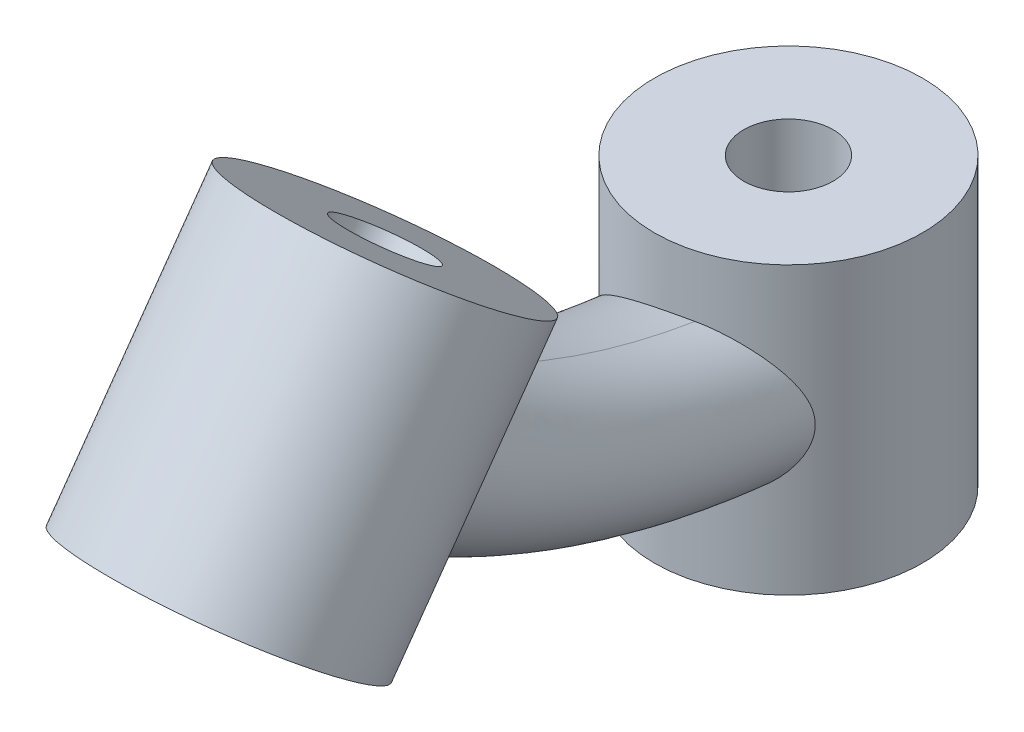
ISO-10303-21;
HEADER;
FILE_DESCRIPTION(('STEP AP214'),'2;1');
FILE_NAME('part.step','',(''),(''),'','','');
FILE_SCHEMA(('AUTOMOTIVE_DESIGN { 1 0 10303 214 1 1 1 1 }'));
ENDSEC;
DATA;
#1=APPLICATION_CONTEXT('core data for automotive mechanical design processes');
#2=APPLICATION_PROTOCOL_DEFINITION('international standard','automotive_design',2000,#1);
#3=PRODUCT_CONTEXT('',#1,'mechanical');
#4=PRODUCT('Part','Part','',(#3));
#5=PRODUCT_RELATED_PRODUCT_CATEGORY('part','',(#4));
#6=PRODUCT_DEFINITION_FORMATION('','',#4);
#7=PRODUCT_DEFINITION_CONTEXT('part definition',#1,'design');
#8=PRODUCT_DEFINITION('design','',#6,#7);
#9=PRODUCT_DEFINITION_SHAPE('','',#8);
#10=(LENGTH_UNIT() NAMED_UNIT(*) SI_UNIT(.MILLI.,.METRE.));
#11=(NAMED_UNIT(*) PLANE_ANGLE_UNIT() SI_UNIT($,.RADIAN.));
#12=(NAMED_UNIT(*) SI_UNIT($,.STERADIAN.) SOLID_ANGLE_UNIT());
#13=UNCERTAINTY_MEASURE_WITH_UNIT(LENGTH_MEASURE(1.E-05),#10,'distance_accuracy_value','');
#14=(GEOMETRIC_REPRESENTATION_CONTEXT(3) GLOBAL_UNCERTAINTY_ASSIGNED_CONTEXT((#13)) GLOBAL_UNIT_ASSIGNED_CONTEXT((#10,
#11,#12)) REPRESENTATION_CONTEXT('',''));
#15=CARTESIAN_POINT('',(0.,0.,0.));
#16=DIRECTION('',(0.,0.,1.));
#17=DIRECTION('',(1.,0.,0.));
#18=AXIS2_PLACEMENT_3D('',#15,#16,#17);
#19=CARTESIAN_POINT('',(-0.6,0.,0.));
#20=CARTESIAN_POINT('',(-0.6,0.,0.999999999999338));
#21=CARTESIAN_POINT('',(-0.6,0.290266959117317,1.90711803257191));
#22=CARTESIAN_POINT('',(-0.6,0.870800877353567,2.72135409771308));
#23=CARTESIAN_POINT('',(-0.407571052090886,-0.256571930545485,0.));
#24=CARTESIAN_POINT('',(-0.407571052090886,-0.256571931736255,1.05083716692525));
#25=CARTESIAN_POINT('',(-0.407571052090886,0.0518441392871162,2.0146732866513));
#26=CARTESIAN_POINT('',(-0.407571052090886,0.661890758200323,2.87030280586194));
#27=CARTESIAN_POINT('',(-0.120714913181857,-0.4,0.));
#28=CARTESIAN_POINT('',(-0.120714913181857,-0.400000001857498,1.07925600718421));
#29=CARTESIAN_POINT('',(-0.120714913181857,-0.0814382688464156,2.07479850151535));
#30=CARTESIAN_POINT('',(-0.120714913181857,0.545106451296765,2.95356766500735));
#31=CARTESIAN_POINT('',(0.2,-0.4,0.));
#32=CARTESIAN_POINT('',(0.2,-0.400000001857498,1.07925600718437));
#33=CARTESIAN_POINT('',(0.2,-0.0814382688462907,2.07479850151514));
#34=CARTESIAN_POINT('',(0.2,0.545106451296765,2.95356766500735));
#35=(BOUNDED_SURFACE() B_SPLINE_SURFACE(3,3,((#19,#20,#21,#22),(#23,#24,#25,#26),(#27,#28,#29,
#30),(#31,#32,#33,#34)),.UNSPECIFIED.,.F.,.F.,.F.) B_SPLINE_SURFACE_WITH_KNOTS((4,4),(4,4),(0.,
1.),(0.,1.),.UNSPECIFIED.) GEOMETRIC_REPRESENTATION_ITEM() RATIONAL_B_SPLINE_SURFACE(((1.,1.,1.,
1.),(0.929618127333277,0.929618127333277,0.929618127333277,0.929618127333277),
(0.929618127333277,0.929618127333277,0.929618127333277,0.929618127333277),(1.,1.,1.,1.))) REPRESENTATION_ITEM('') SURFACE());
#36=CARTESIAN_POINT('',(-0.6,0.,0.));
#37=CARTESIAN_POINT('',(-0.6,0.,0.999999999999338));
#38=CARTESIAN_POINT('',(-0.6,0.290266959117317,1.90711803257191));
#39=CARTESIAN_POINT('',(-0.6,0.870800877353567,2.72135409771308));
#40=B_SPLINE_CURVE_WITH_KNOTS('',3,(#36,#37,#38,#39),.UNSPECIFIED.,.F.,.F.,(4,4),(0.,1.),.UNSPECIFIED.);
#41=CARTESIAN_POINT('',(-0.6,0.0201587613450963,0.450000000000001));
#42=VERTEX_POINT('',#41);
#43=CARTESIAN_POINT('',(-0.6,0.625974604663066,2.34324502368889));
#44=VERTEX_POINT('',#43);
#45=EDGE_CURVE('E11',#42,#44,#40,.T.);
#46=CARTESIAN_POINT('',(-0.6,0.0201587613450963,0.45));
#47=CARTESIAN_POINT('',(-0.584587443213233,0.00139531344069298,0.470538525789359));
#48=CARTESIAN_POINT('',(-0.568031378733616,-0.0171719864093529,0.490425282404676));
#49=CARTESIAN_POINT('',(-0.532560625569064,-0.0536873259788895,0.528739702830661));
#50=CARTESIAN_POINT('',(-0.513639854315317,-0.0716336105399426,0.547163395868869));
#51=CARTESIAN_POINT('',(-0.473292904457342,-0.106713995635153,0.582422258254777));
#52=CARTESIAN_POINT('',(-0.451848429824051,-0.12384071617806,0.599243996794583));
#53=CARTESIAN_POINT('',(-0.406633742967167,-0.156832183922296,0.63080005089821));
#54=CARTESIAN_POINT('',(-0.382866411422283,-0.172698451068325,0.645536897856092));
#55=CARTESIAN_POINT('',(-0.325448646158615,-0.207531768345037,0.676720222443428));
#56=CARTESIAN_POINT('',(-0.290996587158312,-0.225966084976135,0.692314461583355));
#57=CARTESIAN_POINT('',(-0.218828158534728,-0.259532512607695,0.718387049720213));
#58=CARTESIAN_POINT('',(-0.181122605215755,-0.274675018090188,0.728881635387156));
#59=CARTESIAN_POINT('',(-0.102907141009716,-0.301251786639477,0.743981971074257));
#60=CARTESIAN_POINT('',(-0.062376422201113,-0.31265399283156,0.748537760541348));
#61=CARTESIAN_POINT('',(0.0198633914054088,-0.331140952992155,0.750859670122158));
#62=CARTESIAN_POINT('',(0.0615712941183749,-0.33822992148127,0.748632430845334));
#63=CARTESIAN_POINT('',(0.11931526124771,-0.345058848003597,0.740633655406134));
#64=CARTESIAN_POINT('',(0.135598967033393,-0.346649338750588,0.737826090288573));
#65=CARTESIAN_POINT('',(0.167963545000202,-0.349168894980234,0.73113606221257));
#66=CARTESIAN_POINT('',(0.184044743552117,-0.350099210365213,0.72725564993294));
#67=CARTESIAN_POINT('',(0.2,-0.350712327549419,0.722841614740117));
#68=B_SPLINE_CURVE_WITH_KNOTS('',3,(#46,#47,#48,#49,#50,#51,#52,#53,#54,#55,#56,#57,#58,#59,#60,
#61,#62,#63,#64,#65,#66,#67),.UNSPECIFIED.,.F.,.F.,(4,2,2,2,2,2,2,2,2,2,4),(0.,
0.0954078810676434,0.191066428818179,0.287467002816868,0.383749507593539,0.509434924609851,
0.634717509177261,0.761047382288681,0.887253617772194,0.937015167500651,0.986682251071779),.UNSPECIFIED.);
#69=CARTESIAN_POINT('',(0.2,-0.350712327549429,0.722841614740047));
#70=VERTEX_POINT('',#69);
#71=EDGE_CURVE('E71',#42,#70,#68,.T.);
#72=CARTESIAN_POINT('',(0.2,-0.4,0.));
#73=CARTESIAN_POINT('',(0.2,-0.400000001857498,1.07925600718437));
#74=CARTESIAN_POINT('',(0.2,-0.0814382688462907,2.07479850151514));
#75=CARTESIAN_POINT('',(0.2,0.545106451296765,2.95356766500735));
#76=B_SPLINE_CURVE_WITH_KNOTS('',3,(#72,#73,#74,#75),.UNSPECIFIED.,.F.,.F.,(4,4),(0.,1.),.UNSPECIFIED.);
#77=CARTESIAN_POINT('',(0.2,0.165604176903971,2.33639078729217));
#78=VERTEX_POINT('',#77);
#79=EDGE_CURVE('E55',#70,#78,#76,.T.);
#80=CARTESIAN_POINT('',(0.200000000000137,0.165604176904175,2.33639078729271));
#81=CARTESIAN_POINT('',(0.181941262604554,0.163266617196625,2.3319193478813));
#82=CARTESIAN_POINT('',(0.163717323877511,0.161660374442873,2.32776896325585));
#83=CARTESIAN_POINT('',(0.127070507381306,0.159937153012685,2.32010387015286));
#84=CARTESIAN_POINT('',(0.1086476715573,0.15981986624351,2.31658903031763));
#85=CARTESIAN_POINT('',(0.0534519281149199,0.161733936090693,2.30701774831416));
#86=CARTESIAN_POINT('',(0.0165679419615086,0.166007306688256,2.30188983672862));
#87=CARTESIAN_POINT('',(-0.0562640213157125,0.180383165161915,2.29400352849927));
#88=CARTESIAN_POINT('',(-0.0922121793480307,0.190484517530904,2.29124467053639));
#89=CARTESIAN_POINT('',(-0.16226292444956,0.21600571236972,2.28785768214124));
#90=CARTESIAN_POINT('',(-0.196365135078597,0.231426634956363,2.28722998471319));
#91=CARTESIAN_POINT('',(-0.263529386862932,0.267699877540855,2.28784124322663));
#92=CARTESIAN_POINT('',(-0.296473422091546,0.288767476877616,2.28916646764925));
#93=CARTESIAN_POINT('',(-0.359181228695517,0.335131993456281,2.29352942979378));
#94=CARTESIAN_POINT('',(-0.388937576992771,0.36043844504315,2.29657106557725));
#95=CARTESIAN_POINT('',(-0.453487372450291,0.422639652869165,2.30524722495249));
#96=CARTESIAN_POINT('',(-0.487074395131384,0.460722084787429,2.31138818811615));
#97=CARTESIAN_POINT('',(-0.532845059641147,0.520796803862251,2.3221659780014));
#98=CARTESIAN_POINT('',(-0.547305024826113,0.541262032674995,2.32600877944175));
#99=CARTESIAN_POINT('',(-0.574746203040941,0.583025760305396,2.33422527822159));
#100=CARTESIAN_POINT('',(-0.587729095067874,0.604323275286021,2.33859836086146));
#101=CARTESIAN_POINT('',(-0.6,0.625974604663335,2.34324502368935));
#102=B_SPLINE_CURVE_WITH_KNOTS('',3,(#80,#81,#82,#83,#84,#85,#86,#87,#88,#89,#90,#91,#92,#93,
#94,#95,#96,#97,#98,#99,#100,#101),.UNSPECIFIED.,.F.,.F.,(4,2,2,2,2,2,2,2,2,2,4),(0.,
0.0562160616954088,0.112420491050407,0.224265045526797,0.336087815889243,0.447933304782028,
0.564869871640369,0.682073082670702,0.834795763875752,0.910800751068311,0.986718461062258),.UNSPECIFIED.);
#103=EDGE_CURVE('E89',#78,#44,#102,.T.);
#104=ORIENTED_EDGE('',*,*,#45,.F.);
#105=ORIENTED_EDGE('',*,*,#71,.T.);
#106=ORIENTED_EDGE('',*,*,#79,.T.);
#107=ORIENTED_EDGE('',*,*,#103,.T.);
#108=EDGE_LOOP('',(#104,#105,#106,#107));
#109=FACE_BOUND('',#108,.T.);
#110=ADVANCED_FACE('F41',(#109),#35,.T.);
#111=CARTESIAN_POINT('',(0.2,-0.4,0.));
#112=CARTESIAN_POINT('',(0.2,-0.400000001857498,1.07925600718424));
#113=CARTESIAN_POINT('',(0.2,-0.0814382688463905,2.07479850151531));
#114=CARTESIAN_POINT('',(0.2,0.545106451296765,2.95356766500735));
#115=CARTESIAN_POINT('',(1.,-0.4,0.));
#116=CARTESIAN_POINT('',(1.,-0.400000001857498,1.07925600718434));
#117=CARTESIAN_POINT('',(1.,-0.0814382688463155,2.07479850151519));
#118=CARTESIAN_POINT('',(1.,0.545106451296765,2.95356766500735));
#119=CARTESIAN_POINT('',(1.,0.4,0.));
#120=CARTESIAN_POINT('',(1.,0.400000001850536,0.920743992823557));
#121=CARTESIAN_POINT('',(1.,0.661972187070284,1.73943756362503));
#122=CARTESIAN_POINT('',(1.,1.19649530341037,2.48914053041881));
#123=CARTESIAN_POINT('',(0.2,0.4,0.));
#124=CARTESIAN_POINT('',(0.2,0.400000001850536,0.920743992823557));
#125=CARTESIAN_POINT('',(0.2,0.661972187070284,1.73943756362503));
#126=CARTESIAN_POINT('',(0.2,1.19649530341037,2.48914053041881));
#127=(BOUNDED_SURFACE() B_SPLINE_SURFACE(3,3,((#111,#112,#113,#114),(#115,#116,#117,#118),(#119,
#120,#121,#122),(#123,#124,#125,#126)),.UNSPECIFIED.,.F.,.F.,
.F.) B_SPLINE_SURFACE_WITH_KNOTS((4,4),(4,4),(0.,1.),(0.,1.),
.UNSPECIFIED.) GEOMETRIC_REPRESENTATION_ITEM() RATIONAL_B_SPLINE_SURFACE(((1.,1.,1.,1.),
(0.333333333333333,0.333333333333333,0.333333333333333,0.333333333333333),(0.333333333333333,
0.333333333333333,0.333333333333333,0.333333333333333),(1.,1.,1.,1.))) REPRESENTATION_ITEM('') SURFACE());
#128=CARTESIAN_POINT('',(0.2,-0.350712327549436,0.722841614740048));
#129=CARTESIAN_POINT('',(0.223198440809561,-0.35161402701254,0.716458010004856));
#130=CARTESIAN_POINT('',(0.246082613646156,-0.350605131325439,0.70889165506089));
#131=CARTESIAN_POINT('',(0.290535401549375,-0.345114258570369,0.691837189556741));
#132=CARTESIAN_POINT('',(0.312111205238153,-0.340653556109341,0.682361112877961));
#133=CARTESIAN_POINT('',(0.353502323333706,-0.328625985457702,0.661870492892668));
#134=CARTESIAN_POINT('',(0.3733221563467,-0.321067389107078,0.650860097726022));
#135=CARTESIAN_POINT('',(0.411003339355719,-0.303138891707105,0.627745985309325));
#136=CARTESIAN_POINT('',(0.428860428107459,-0.292763037204828,0.615639989361867));
#137=CARTESIAN_POINT('',(0.464193099184372,-0.268157769456612,0.589540719754816));
#138=CARTESIAN_POINT('',(0.481416306727753,-0.253632105538677,0.575485324201221));
#139=CARTESIAN_POINT('',(0.512931994250749,-0.22151649448459,0.547578101701784));
#140=CARTESIAN_POINT('',(0.527226236792752,-0.203928402083334,0.533726157012378));
#141=CARTESIAN_POINT('',(0.548843358999335,-0.171215361690141,0.511310590897767));
#142=CARTESIAN_POINT('',(0.556982124998121,-0.156876263084127,0.50238581245081));
#143=CARTESIAN_POINT('',(0.571412063749765,-0.126569860664229,0.485908959849383));
#144=CARTESIAN_POINT('',(0.577706851005974,-0.110605825937708,0.478354211439915));
#145=CARTESIAN_POINT('',(0.586978356508166,-0.0808562295243253,0.466903126110001));
#146=CARTESIAN_POINT('',(0.590381719906798,-0.0673763353091936,0.462566796392126));
#147=CARTESIAN_POINT('',(0.595710467783122,-0.0396909137633582,0.455684433532));
#148=CARTESIAN_POINT('',(0.597638120261482,-0.0254865358684906,0.453135653635773));
#149=CARTESIAN_POINT('',(0.599913229485769,0.00333523537774209,0.450119995362741));
#150=CARTESIAN_POINT('',(0.600253837793294,0.0179541453252491,0.449662139945218));
#151=CARTESIAN_POINT('',(0.59936906696517,0.0470561953309648,0.450840434208078));
#152=CARTESIAN_POINT('',(0.598142180214744,0.0615391911638052,0.452478599841099));
#153=CARTESIAN_POINT('',(0.591396189058942,0.111154118891839,0.461314923594464));
#154=CARTESIAN_POINT('',(0.582207610408515,0.144973612646003,0.473158316153888));
#155=CARTESIAN_POINT('',(0.565246979169336,0.188569356709802,0.493003823104953));
#156=CARTESIAN_POINT('',(0.559937984730962,0.200587777278574,0.499041594330557));
#157=CARTESIAN_POINT('',(0.548450439132271,0.22391530951294,0.511638921068436));
#158=CARTESIAN_POINT('',(0.54227329024654,0.235225523332616,0.51819762786044));
#159=CARTESIAN_POINT('',(0.522496447178229,0.268170127998405,0.538378601652795));
#160=CARTESIAN_POINT('',(0.507669083360884,0.288774336581995,0.552483975105127));
#161=CARTESIAN_POINT('',(0.474099102596084,0.328238853164511,0.581593954526945));
#162=CARTESIAN_POINT('',(0.455193261719001,0.346953216035461,0.596607245454539));
#163=CARTESIAN_POINT('',(0.414003713720097,0.38093134058387,0.625888817664195));
#164=CARTESIAN_POINT('',(0.391725168451706,0.396200287949445,0.64015819337918));
#165=CARTESIAN_POINT('',(0.349760439332642,0.419206746903591,0.663775635515557));
#166=CARTESIAN_POINT('',(0.330780622960688,0.427872962941566,0.673471849859542));
#167=CARTESIAN_POINT('',(0.291154463353131,0.442185893154792,0.69151781455574));
#168=CARTESIAN_POINT('',(0.270513811970281,0.447842453541062,0.69987189235622));
#169=CARTESIAN_POINT('',(0.23315615890355,0.454640089493364,0.713047695234921));
#170=CARTESIAN_POINT('',(0.216701441940723,0.456543520426429,0.718234746380307));
#171=CARTESIAN_POINT('',(0.2,0.45728982813227,0.722841614740048));
#172=B_SPLINE_CURVE_WITH_KNOTS('',3,(#128,#129,#130,#131,#132,#133,#134,#135,#136,#137,#138,
#139,#140,#141,#142,#143,#144,#145,#146,#147,#148,#149,#150,#151,#152,#153,#154,#155,#156,#157,
#158,#159,#160,#161,#162,#163,#164,#165,#166,#167,#168,#169,#170,#171),.UNSPECIFIED.,.F.,.F.,(4,
2,2,2,2,2,2,2,2,2,2,2,2,2,2,2,2,2,2,2,2,4),(0.,0.0720418173388671,0.143643119873242,
0.21505446904637,0.286617915824106,0.365958818802292,0.44525183569543,0.50133596862102,
0.557309420247027,0.60082811720085,0.644279795819657,0.687918805229716,0.7315998181981,
0.840220965192159,0.883611970918283,0.926933678643765,1.01373211558155,1.10503398254156,
1.19619750078291,1.2649797340071,1.333535537769,1.38546689173302),.UNSPECIFIED.);
#173=CARTESIAN_POINT('',(0.2,0.457289828132152,0.722841614739329));
#174=VERTEX_POINT('',#173);
#175=EDGE_CURVE('E81',#70,#174,#172,.T.);
#176=CARTESIAN_POINT('',(0.2,0.4,0.));
#177=CARTESIAN_POINT('',(0.2,0.400000001850536,0.920743992823557));
#178=CARTESIAN_POINT('',(0.2,0.661972187070284,1.73943756362503));
#179=CARTESIAN_POINT('',(0.2,1.19649530341037,2.48914053041881));
#180=B_SPLINE_CURVE_WITH_KNOTS('',3,(#176,#177,#178,#179),.UNSPECIFIED.,.F.,.F.,(4,4),(0.,1.),.UNSPECIFIED.);
#181=CARTESIAN_POINT('',(0.2,0.823508672772688,1.86731812991215));
#182=VERTEX_POINT('',#181);
#183=EDGE_CURVE('E48',#174,#182,#180,.T.);
#184=CARTESIAN_POINT('',(0.2,0.823508672772359,1.86731812991148));
#185=CARTESIAN_POINT('',(0.222614835580055,0.826301410846213,1.87297891076137));
#186=CARTESIAN_POINT('',(0.244718747463157,0.827989214957752,1.88071992143428));
#187=CARTESIAN_POINT('',(0.287276579750553,0.8294189715367,1.89955410277512));
#188=CARTESIAN_POINT('',(0.30774450495664,0.829179764867356,1.910613800424));
#189=CARTESIAN_POINT('',(0.351171008604126,0.826830113740818,1.9381491603601));
#190=CARTESIAN_POINT('',(0.373684121804162,0.824318827125845,1.9552812761909));
#191=CARTESIAN_POINT('',(0.415889869613652,0.81716365230879,1.99246851966744));
#192=CARTESIAN_POINT('',(0.435569285823648,0.812510169157841,2.01253651835821));
#193=CARTESIAN_POINT('',(0.472284910400166,0.801029172608768,2.05498758942071));
#194=CARTESIAN_POINT('',(0.489271440523179,0.794166621190608,2.07740375081273));
#195=CARTESIAN_POINT('',(0.520146755127494,0.778006761136653,2.12342966162355));
#196=CARTESIAN_POINT('',(0.534040165858618,0.768713134463943,2.14703756283573));
#197=CARTESIAN_POINT('',(0.554802142506905,0.750189796866252,2.18734598530891));
#198=CARTESIAN_POINT('',(0.562526074055283,0.741784325270552,2.20398479140829));
#199=CARTESIAN_POINT('',(0.576117064498727,0.722943923365562,2.23688300044456));
#200=CARTESIAN_POINT('',(0.581986831542747,0.712511989189534,2.25314292429094));
#201=CARTESIAN_POINT('',(0.590324608702225,0.691962474602005,2.28065352615866));
#202=CARTESIAN_POINT('',(0.593273109576901,0.682388597750875,2.29215881937014));
#203=CARTESIAN_POINT('',(0.597658117518798,0.661666271936132,2.3139652072999));
#204=CARTESIAN_POINT('',(0.599097943508045,0.650521340709707,2.32426890080694));
#205=CARTESIAN_POINT('',(0.600286165374749,0.626657863675253,2.34322484337045));
#206=CARTESIAN_POINT('',(0.600020682614635,0.613927234931514,2.35186295104354));
#207=CARTESIAN_POINT('',(0.59771997718803,0.587407120643206,2.36702438066417));
#208=CARTESIAN_POINT('',(0.595683479507614,0.5736168787692,2.37354617435928));
#209=CARTESIAN_POINT('',(0.589677086757711,0.544123752114352,2.38505699129562));
#210=CARTESIAN_POINT('',(0.585529481688536,0.528370273449955,2.38981861632642));
#211=CARTESIAN_POINT('',(0.575504314410694,0.49689966757977,2.39720483381998));
#212=CARTESIAN_POINT('',(0.569621950948738,0.481182764928031,2.39982341807631));
#213=CARTESIAN_POINT('',(0.553479856219141,0.443483950865959,2.40418117659165));
#214=CARTESIAN_POINT('',(0.542428338352509,0.421743525910174,2.40504540644391));
#215=CARTESIAN_POINT('',(0.517668362829272,0.379885406545647,2.40450827578046));
#216=CARTESIAN_POINT('',(0.503957120567579,0.359769444408931,2.40310452941337));
#217=CARTESIAN_POINT('',(0.473611552704037,0.321004699770798,2.39869251382134));
#218=CARTESIAN_POINT('',(0.456897171598638,0.302424218904219,2.39563392409665));
#219=CARTESIAN_POINT('',(0.421049320163521,0.268000575478259,2.38839574971457));
#220=CARTESIAN_POINT('',(0.401915026655334,0.252158348747812,2.38421578305475));
#221=CARTESIAN_POINT('',(0.359332025834304,0.222292993262691,2.37459006698002));
#222=CARTESIAN_POINT('',(0.335641085765913,0.208638700321171,2.36905725753368));
#223=CARTESIAN_POINT('',(0.286216190390452,0.186284669071733,2.35735665478975));
#224=CARTESIAN_POINT('',(0.260489138694672,0.177568942619448,2.35119098777596));
#225=CARTESIAN_POINT('',(0.222901697017537,0.169108903884348,2.34203184239502));
#226=CARTESIAN_POINT('',(0.211480277708603,0.167081649907864,2.3392295126772));
#227=CARTESIAN_POINT('',(0.2,0.165604176903915,2.33639078729219));
#228=B_SPLINE_CURVE_WITH_KNOTS('',3,(#184,#185,#186,#187,#188,#189,#190,#191,#192,#193,#194,
#195,#196,#197,#198,#199,#200,#201,#202,#203,#204,#205,#206,#207,#208,#209,#210,#211,#212,#213,
#214,#215,#216,#217,#218,#219,#220,#221,#222,#223,#224,#225,#226,#227),.UNSPECIFIED.,.F.,.F.,(4,
2,2,2,2,2,2,2,2,2,2,2,2,2,2,2,2,2,2,2,2,4),(0.,0.0701378990030071,0.139590880783669,
0.224352915953083,0.309498352570331,0.396066963388701,0.482505214070672,0.542902648722012,
0.60321145599082,0.64881337341826,0.694314759567173,0.740186924842987,0.786092142417526,
0.836730913003255,0.887511172202298,0.960330940386254,1.03322736294336,1.10847636214928,
1.18375102790874,1.26697581605618,1.34992960939601,1.38568438888744),.UNSPECIFIED.);
#229=EDGE_CURVE('E63',#182,#78,#228,.T.);
#230=ORIENTED_EDGE('',*,*,#79,.F.);
#231=ORIENTED_EDGE('',*,*,#175,.T.);
#232=ORIENTED_EDGE('',*,*,#183,.T.);
#233=ORIENTED_EDGE('',*,*,#229,.T.);
#234=EDGE_LOOP('',(#230,#231,#232,#233));
#235=FACE_BOUND('',#234,.T.);
#236=ADVANCED_FACE('F97',(#235),#127,.T.);
#237=CARTESIAN_POINT('',(0.2,0.4,0.));
#238=CARTESIAN_POINT('',(0.2,0.400000001850536,0.920743992823311));
#239=CARTESIAN_POINT('',(0.2,0.661972187070085,1.73943756362536));
#240=CARTESIAN_POINT('',(0.2,1.19649530341037,2.48914053041881));
#241=CARTESIAN_POINT('',(-0.120714913181856,0.4,0.));
#242=CARTESIAN_POINT('',(-0.120714913181856,0.400000001850536,0.920743992823662));
#243=CARTESIAN_POINT('',(-0.120714913181856,0.661972187070369,1.73943756362489));
#244=CARTESIAN_POINT('',(-0.120714913181856,1.19649530341037,2.48914053041881));
#245=CARTESIAN_POINT('',(-0.407571052090886,0.256571930545485,0.));
#246=CARTESIAN_POINT('',(-0.407571052090886,0.256571931733369,0.949162833077231));
#247=CARTESIAN_POINT('',(-0.407571052090886,0.528689778943186,1.79956277849101));
#248=CARTESIAN_POINT('',(-0.407571052090886,1.07971099650681,2.57240538956422));
#249=CARTESIAN_POINT('',(-0.6,0.,0.));
#250=CARTESIAN_POINT('',(-0.6,0.,0.999999999999338));
#251=CARTESIAN_POINT('',(-0.6,0.290266959117317,1.9071180325719));
#252=CARTESIAN_POINT('',(-0.6,0.870800877353567,2.72135409771308));
#253=(BOUNDED_SURFACE() B_SPLINE_SURFACE(3,3,((#237,#238,#239,#240),(#241,#242,#243,#244),(#245,
#246,#247,#248),(#249,#250,#251,#252)),.UNSPECIFIED.,.F.,.F.,
.F.) B_SPLINE_SURFACE_WITH_KNOTS((4,4),(4,4),(0.,1.),(0.,1.),
.UNSPECIFIED.) GEOMETRIC_REPRESENTATION_ITEM() RATIONAL_B_SPLINE_SURFACE(((1.,1.,1.,1.),
(0.929618127333277,0.929618127333277,0.929618127333277,0.929618127333277),(0.929618127333277,
0.929618127333277,0.929618127333277,0.929618127333277),(1.,1.,1.,1.))) REPRESENTATION_ITEM('') SURFACE());
#254=CARTESIAN_POINT('',(0.2,0.457289828132247,0.722841614740048));
#255=CARTESIAN_POINT('',(0.1841423013828,0.458009432082257,0.727230717813258));
#256=CARTESIAN_POINT('',(0.16812537444619,0.45826499442294,0.731098436488274));
#257=CARTESIAN_POINT('',(0.135887260163104,0.457806690880543,0.737770624394232));
#258=CARTESIAN_POINT('',(0.119666092612401,0.457092918243315,0.740575195862162));
#259=CARTESIAN_POINT('',(0.0710939547149945,0.453452990463266,0.747332442898296));
#260=CARTESIAN_POINT('',(0.0386058845223538,0.449039519016809,0.749691459279151));
#261=CARTESIAN_POINT('',(-0.0256144403640448,0.436310150052704,0.750252281425305));
#262=CARTESIAN_POINT('',(-0.0573463470305701,0.427992490725895,0.748452208914539));
#263=CARTESIAN_POINT('',(-0.119235463925789,0.407902626801765,0.74111781819637));
#264=CARTESIAN_POINT('',(-0.149391763787,0.396128450510669,0.735581366306191));
#265=CARTESIAN_POINT('',(-0.216999726574429,0.36547279957748,0.719015132890842));
#266=CARTESIAN_POINT('',(-0.253669705909798,0.345523729072085,0.70678989559476));
#267=CARTESIAN_POINT('',(-0.323055762950258,0.301934324483126,0.677907841481814));
#268=CARTESIAN_POINT('',(-0.355748173148502,0.278273646792727,0.661226221894188));
#269=CARTESIAN_POINT('',(-0.408340492234567,0.235518164677636,0.629614833386091));
#270=CARTESIAN_POINT('',(-0.429247433269207,0.217018342507041,0.615518474846566));
#271=CARTESIAN_POINT('',(-0.469023330765406,0.179054575303368,0.585776507482816));
#272=CARTESIAN_POINT('',(-0.487890451415642,0.159589784411688,0.570129526992854));
#273=CARTESIAN_POINT('',(-0.523360741548087,0.120311130634031,0.537738303831664));
#274=CARTESIAN_POINT('',(-0.539994848162669,0.100507571154875,0.521015186513095));
#275=CARTESIAN_POINT('',(-0.571378975451171,0.0605469477109454,0.486381579294439));
#276=CARTESIAN_POINT('',(-0.586132894061758,0.0403907169821466,0.468473666826278));
#277=CARTESIAN_POINT('',(-0.6,0.0201587613450979,0.450000000000015));
#278=B_SPLINE_CURVE_WITH_KNOTS('',3,(#254,#255,#256,#257,#258,#259,#260,#261,#262,#263,#264,
#265,#266,#267,#268,#269,#270,#271,#272,#273,#274,#275,#276,#277),.UNSPECIFIED.,.F.,.F.,(4,2,2,
2,2,2,2,2,2,2,2,4),(0.,0.049380400279777,0.0987560507141791,0.196805913718157,0.29490006543776,
0.39305028188882,0.522837743067863,0.653363177529483,0.747066069286815,0.840852602458098,
0.933164236889569,1.02528126822359),.UNSPECIFIED.);
#279=EDGE_CURVE('E84',#174,#42,#278,.T.);
#280=CARTESIAN_POINT('',(-0.600000000000001,0.625974604663066,2.34324502368889));
#281=CARTESIAN_POINT('',(-0.585773996146824,0.631872800769662,2.31576562556703));
#282=CARTESIAN_POINT('',(-0.570614792295609,0.638051194246228,2.28881597154894));
#283=CARTESIAN_POINT('',(-0.538316122323168,0.650826132154117,2.23614439243811));
#284=CARTESIAN_POINT('',(-0.521172001473429,0.657423642404493,2.21042556159604));
#285=CARTESIAN_POINT('',(-0.484598849420443,0.670960374515699,2.16016287392725));
#286=CARTESIAN_POINT('',(-0.465140795431769,0.677903121276075,2.13564092372153));
#287=CARTESIAN_POINT('',(-0.424078008982969,0.691898285484517,2.08854102697137));
#288=CARTESIAN_POINT('',(-0.402475563016873,0.698950579497389,2.06596105671796));
#289=CARTESIAN_POINT('',(-0.350813298908674,0.714963126378064,2.01728912802814));
#290=CARTESIAN_POINT('',(-0.320055189744873,0.723918324127045,1.99192274539255));
#291=CARTESIAN_POINT('',(-0.255024084513455,0.741447218740828,1.94628598668235));
#292=CARTESIAN_POINT('',(-0.220768094358638,0.750022495685895,1.92599246698186));
#293=CARTESIAN_POINT('',(-0.154989211782107,0.76510531731391,1.89469166819178));
#294=CARTESIAN_POINT('',(-0.123964284662446,0.771719106273074,1.88269983342191));
#295=CARTESIAN_POINT('',(-0.0602070063793653,0.784263974992299,1.86407172406867));
#296=CARTESIAN_POINT('',(-0.0274759150635017,0.790195548413124,1.85743155577421));
#297=CARTESIAN_POINT('',(0.0379019205271648,0.801094133179481,1.85027262900804));
#298=CARTESIAN_POINT('',(0.0705262036914663,0.806083194554412,1.84959046027633));
#299=CARTESIAN_POINT('',(0.11930792555126,0.813004181963036,1.85295529827952));
#300=CARTESIAN_POINT('',(0.13560155619439,0.815224431165773,1.85482311661474));
#301=CARTESIAN_POINT('',(0.167983729582887,0.819491317619917,1.85999982158423));
#302=CARTESIAN_POINT('',(0.184072247698291,0.821537934185251,1.86330887963624));
#303=CARTESIAN_POINT('',(0.2,0.823508672772258,1.86731812991155));
#304=B_SPLINE_CURVE_WITH_KNOTS('',3,(#280,#281,#282,#283,#284,#285,#286,#287,#288,#289,#290,
#291,#292,#293,#294,#295,#296,#297,#298,#299,#300,#301,#302,#303),.UNSPECIFIED.,.F.,.F.,(4,2,2,
2,2,2,2,2,2,2,2,4),(0.,0.0944994680883219,0.189225210584571,0.285297850128333,0.381269129043779,
0.503456735227451,0.625076277651362,0.726398946771323,0.827647829855202,0.926110730736829,
0.975703429409417,1.0253020281348),.UNSPECIFIED.);
#305=EDGE_CURVE('E98',#44,#182,#304,.T.);
#306=ORIENTED_EDGE('',*,*,#183,.F.);
#307=ORIENTED_EDGE('',*,*,#279,.T.);
#308=ORIENTED_EDGE('',*,*,#45,.T.);
#309=ORIENTED_EDGE('',*,*,#305,.T.);
#310=EDGE_LOOP('',(#306,#307,#308,#309));
#311=FACE_BOUND('',#310,.T.);
#312=ADVANCED_FACE('F43',(#311),#253,.T.);
#313=CARTESIAN_POINT('',(0.,0.219412025239965,3.18578123230162));
#314=DIRECTION('',(0.,0.814236065142004,-0.580533918235676));
#315=DIRECTION('',(0.,0.580533918235676,0.814236065142004));
#316=AXIS2_PLACEMENT_3D('',#313,#314,#315);
#317=PLANE('',#316);
#318=CARTESIAN_POINT('',(0.,0.219412025239965,3.18578123230162));
#319=DIRECTION('',(0.,0.814236065142004,-0.580533918235676));
#320=DIRECTION('',(0.,0.580533918235676,0.814236065142004));
#321=AXIS2_PLACEMENT_3D('',#318,#319,#320);
#322=CIRCLE('',#321,0.75);
#323=CARTESIAN_POINT('',(0.,0.654812463916722,3.79645828115812));
#324=VERTEX_POINT('',#323);
#325=EDGE_CURVE('E217',#324,#324,#322,.T.);
#326=ORIENTED_EDGE('',*,*,#325,.F.);
#327=EDGE_LOOP('',(#326));
#328=FACE_BOUND('',#327,.T.);
#329=CARTESIAN_POINT('',(0.,0.219412025239965,3.18578123230162));
#330=DIRECTION('',(0.,0.814236065142004,-0.580533918235676));
#331=DIRECTION('',(0.,0.580533918235676,0.814236065142004));
#332=AXIS2_PLACEMENT_3D('',#329,#330,#331);
#333=CIRCLE('',#332,0.25);
#334=CARTESIAN_POINT('',(0.,0.364545504798884,3.38934024858712));
#335=VERTEX_POINT('',#334);
#336=EDGE_CURVE('E95',#335,#335,#333,.T.);
#337=ORIENTED_EDGE('',*,*,#336,.T.);
#338=EDGE_LOOP('',(#337));
#339=FACE_BOUND('',#338,.T.);
#340=ADVANCED_FACE('F163',(#328,#339),#317,.F.);
#341=CARTESIAN_POINT('',(0.,1.52218972946717,2.25692696312454));
#342=DIRECTION('',(0.,0.814236065142004,-0.580533918235676));
#343=DIRECTION('',(0.,0.580533918235676,0.814236065142004));
#344=AXIS2_PLACEMENT_3D('',#341,#342,#343);
#345=PLANE('',#344);
#346=CARTESIAN_POINT('',(0.,1.52218972946717,2.25692696312454));
#347=DIRECTION('',(0.,0.814236065142004,-0.580533918235676));
#348=DIRECTION('',(0.,0.580533918235676,0.814236065142004));
#349=AXIS2_PLACEMENT_3D('',#346,#347,#348);
#350=CIRCLE('',#349,0.75);
#351=CARTESIAN_POINT('',(0.,1.95759016814393,2.86760401198104));
#352=VERTEX_POINT('',#351);
#353=EDGE_CURVE('E211',#352,#352,#350,.T.);
#354=ORIENTED_EDGE('',*,*,#353,.T.);
#355=EDGE_LOOP('',(#354));
#356=FACE_BOUND('',#355,.T.);
#357=CARTESIAN_POINT('',(0.,1.52218972946717,2.25692696312454));
#358=DIRECTION('',(0.,0.814236065142004,-0.580533918235676));
#359=DIRECTION('',(0.,0.580533918235676,0.814236065142004));
#360=AXIS2_PLACEMENT_3D('',#357,#358,#359);
#361=CIRCLE('',#360,0.25);
#362=CARTESIAN_POINT('',(0.,1.66732320902609,2.46048597941004));
#363=VERTEX_POINT('',#362);
#364=EDGE_CURVE('E220',#363,#363,#361,.T.);
#365=ORIENTED_EDGE('',*,*,#364,.F.);
#366=EDGE_LOOP('',(#365));
#367=FACE_BOUND('',#366,.T.);
#368=ADVANCED_FACE('F180',(#356,#367),#345,.T.);
#369=CARTESIAN_POINT('',(0.,1.52218972946717,2.25692696312454));
#370=DIRECTION('',(0.,-0.814236065142004,0.580533918235676));
#371=DIRECTION('',(0.,-0.580533918235676,-0.814236065142004));
#372=AXIS2_PLACEMENT_3D('',#369,#370,#371);
#373=CYLINDRICAL_SURFACE('',#372,0.25);
#374=ORIENTED_EDGE('',*,*,#364,.T.);
#375=EDGE_LOOP('',(#374));
#376=FACE_BOUND('',#375,.T.);
#377=ORIENTED_EDGE('',*,*,#336,.F.);
#378=EDGE_LOOP('',(#377));
#379=FACE_BOUND('',#378,.T.);
#380=ADVANCED_FACE('F171',(#376,#379),#373,.F.);
#381=CARTESIAN_POINT('',(0.,1.52218972946717,2.25692696312454));
#382=DIRECTION('',(0.,-0.814236065142004,0.580533918235676));
#383=DIRECTION('',(0.,-0.580533918235676,-0.814236065142004));
#384=AXIS2_PLACEMENT_3D('',#381,#382,#383);
#385=CYLINDRICAL_SURFACE('',#384,0.75);
#386=ORIENTED_EDGE('',*,*,#103,.F.);
#387=ORIENTED_EDGE('',*,*,#229,.F.);
#388=ORIENTED_EDGE('',*,*,#305,.F.);
#389=EDGE_LOOP('',(#386,#387,#388));
#390=FACE_BOUND('',#389,.T.);
#391=ORIENTED_EDGE('',*,*,#353,.F.);
#392=EDGE_LOOP('',(#391));
#393=FACE_BOUND('',#392,.T.);
#394=ORIENTED_EDGE('',*,*,#325,.T.);
#395=EDGE_LOOP('',(#394));
#396=FACE_BOUND('',#395,.T.);
#397=ADVANCED_FACE('F165',(#390,#393,#396),#385,.T.);
#398=CARTESIAN_POINT('',(0.,-0.8,0.));
#399=DIRECTION('',(0.,1.,0.));
#400=DIRECTION('',(0.,0.,1.));
#401=AXIS2_PLACEMENT_3D('',#398,#399,#400);
#402=PLANE('',#401);
#403=CARTESIAN_POINT('',(0.,-0.8,0.));
#404=DIRECTION('',(0.,1.,0.));
#405=DIRECTION('',(0.,0.,1.));
#406=AXIS2_PLACEMENT_3D('',#403,#404,#405);
#407=CIRCLE('',#406,0.75);
#408=CARTESIAN_POINT('',(0.,-0.8,0.75));
#409=VERTEX_POINT('',#408);
#410=EDGE_CURVE('E208',#409,#409,#407,.T.);
#411=ORIENTED_EDGE('',*,*,#410,.F.);
#412=EDGE_LOOP('',(#411));
#413=FACE_BOUND('',#412,.T.);
#414=CARTESIAN_POINT('',(0.,-0.8,0.));
#415=DIRECTION('',(0.,1.,0.));
#416=DIRECTION('',(0.,0.,1.));
#417=AXIS2_PLACEMENT_3D('',#414,#415,#416);
#418=CIRCLE('',#417,0.25);
#419=CARTESIAN_POINT('',(0.,-0.8,0.25));
#420=VERTEX_POINT('',#419);
#421=EDGE_CURVE('E207',#420,#420,#418,.T.);
#422=ORIENTED_EDGE('',*,*,#421,.T.);
#423=EDGE_LOOP('',(#422));
#424=FACE_BOUND('',#423,.T.);
#425=ADVANCED_FACE('F170',(#413,#424),#402,.F.);
#426=CARTESIAN_POINT('',(0.,0.8,0.));
#427=DIRECTION('',(0.,1.,0.));
#428=DIRECTION('',(0.,0.,1.));
#429=AXIS2_PLACEMENT_3D('',#426,#427,#428);
#430=PLANE('',#429);
#431=CARTESIAN_POINT('',(0.,0.8,0.));
#432=DIRECTION('',(0.,1.,0.));
#433=DIRECTION('',(0.,0.,1.));
#434=AXIS2_PLACEMENT_3D('',#431,#432,#433);
#435=CIRCLE('',#434,0.75);
#436=CARTESIAN_POINT('',(0.,0.8,0.75));
#437=VERTEX_POINT('',#436);
#438=EDGE_CURVE('E203',#437,#437,#435,.T.);
#439=ORIENTED_EDGE('',*,*,#438,.T.);
#440=EDGE_LOOP('',(#439));
#441=FACE_BOUND('',#440,.T.);
#442=CARTESIAN_POINT('',(0.,0.8,0.));
#443=DIRECTION('',(0.,1.,0.));
#444=DIRECTION('',(0.,0.,1.));
#445=AXIS2_PLACEMENT_3D('',#442,#443,#444);
#446=CIRCLE('',#445,0.25);
#447=CARTESIAN_POINT('',(0.,0.8,0.25));
#448=VERTEX_POINT('',#447);
#449=EDGE_CURVE('E206',#448,#448,#446,.T.);
#450=ORIENTED_EDGE('',*,*,#449,.F.);
#451=EDGE_LOOP('',(#450));
#452=FACE_BOUND('',#451,.T.);
#453=ADVANCED_FACE('F177',(#441,#452),#430,.T.);
#454=CARTESIAN_POINT('',(0.,0.8,0.));
#455=DIRECTION('',(0.,-1.,0.));
#456=DIRECTION('',(0.,0.,-1.));
#457=AXIS2_PLACEMENT_3D('',#454,#455,#456);
#458=CYLINDRICAL_SURFACE('',#457,0.25);
#459=ORIENTED_EDGE('',*,*,#449,.T.);
#460=EDGE_LOOP('',(#459));
#461=FACE_BOUND('',#460,.T.);
#462=ORIENTED_EDGE('',*,*,#421,.F.);
#463=EDGE_LOOP('',(#462));
#464=FACE_BOUND('',#463,.T.);
#465=ADVANCED_FACE('F192',(#461,#464),#458,.F.);
#466=CARTESIAN_POINT('',(0.,0.8,0.));
#467=DIRECTION('',(0.,-1.,0.));
#468=DIRECTION('',(0.,0.,-1.));
#469=AXIS2_PLACEMENT_3D('',#466,#467,#468);
#470=CYLINDRICAL_SURFACE('',#469,0.75);
#471=ORIENTED_EDGE('',*,*,#71,.F.);
#472=ORIENTED_EDGE('',*,*,#279,.F.);
#473=ORIENTED_EDGE('',*,*,#175,.F.);
#474=EDGE_LOOP('',(#471,#472,#473));
#475=FACE_BOUND('',#474,.T.);
#476=ORIENTED_EDGE('',*,*,#438,.F.);
#477=EDGE_LOOP('',(#476));
#478=FACE_BOUND('',#477,.T.);
#479=ORIENTED_EDGE('',*,*,#410,.T.);
#480=EDGE_LOOP('',(#479));
#481=FACE_BOUND('',#480,.T.);
#482=ADVANCED_FACE('F82',(#475,#478,#481),#470,.T.);
#483=CLOSED_SHELL('',(#110,#236,#312,#340,#368,#380,#397,#425,#453,#465,#482));
#484=MANIFOLD_SOLID_BREP('B2',#483);
#485=ADVANCED_BREP_SHAPE_REPRESENTATION('',(#18,#484),#14);
#486=SHAPE_DEFINITION_REPRESENTATION(#9,#485);
ENDSEC;
END-ISO-10303-21;
